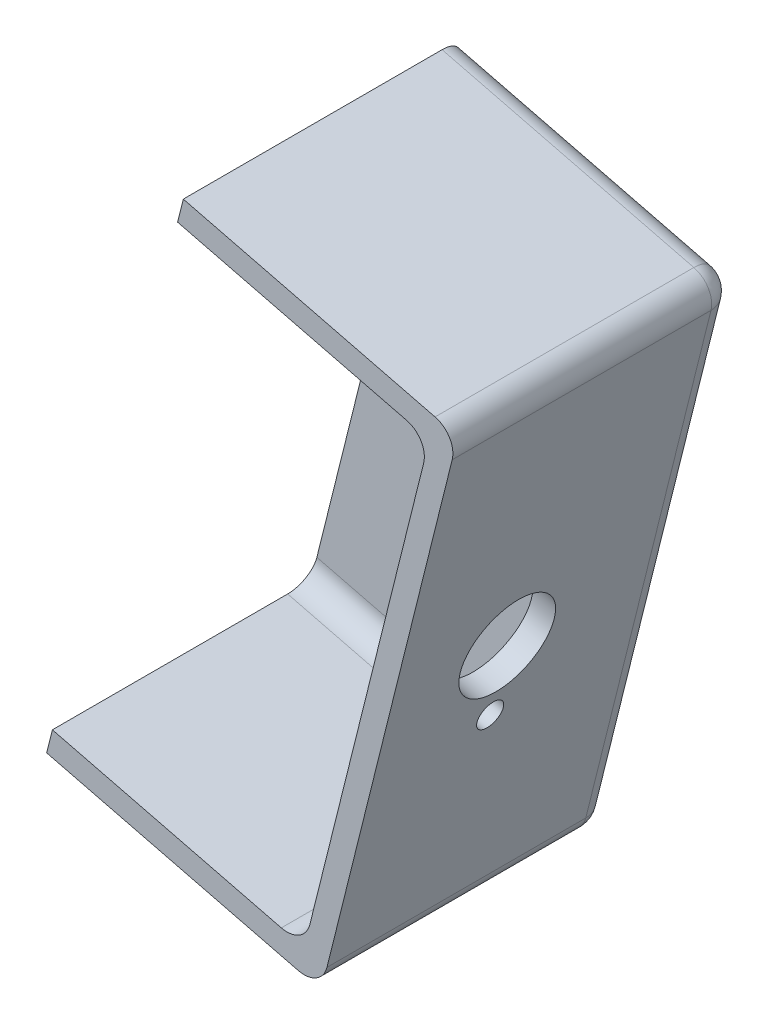
ISO-10303-21;
HEADER;
FILE_DESCRIPTION(('STEP AP214'),'2;1');
FILE_NAME('part.step','',(''),(''),'','','');
FILE_SCHEMA(('AUTOMOTIVE_DESIGN { 1 0 10303 214 1 1 1 1 }'));
ENDSEC;
DATA;
#1=APPLICATION_CONTEXT('core data for automotive mechanical design processes');
#2=APPLICATION_PROTOCOL_DEFINITION('international standard','automotive_design',2000,#1);
#3=PRODUCT_CONTEXT('',#1,'mechanical');
#4=PRODUCT('Part','Part','',(#3));
#5=PRODUCT_RELATED_PRODUCT_CATEGORY('part','',(#4));
#6=PRODUCT_DEFINITION_FORMATION('','',#4);
#7=PRODUCT_DEFINITION_CONTEXT('part definition',#1,'design');
#8=PRODUCT_DEFINITION('design','',#6,#7);
#9=PRODUCT_DEFINITION_SHAPE('','',#8);
#10=(LENGTH_UNIT() NAMED_UNIT(*) SI_UNIT(.MILLI.,.METRE.));
#11=(NAMED_UNIT(*) PLANE_ANGLE_UNIT() SI_UNIT($,.RADIAN.));
#12=(NAMED_UNIT(*) SI_UNIT($,.STERADIAN.) SOLID_ANGLE_UNIT());
#13=UNCERTAINTY_MEASURE_WITH_UNIT(LENGTH_MEASURE(1.E-05),#10,'distance_accuracy_value','');
#14=(GEOMETRIC_REPRESENTATION_CONTEXT(3) GLOBAL_UNCERTAINTY_ASSIGNED_CONTEXT((#13)) GLOBAL_UNIT_ASSIGNED_CONTEXT((#10,
#11,#12)) REPRESENTATION_CONTEXT('',''));
#15=CARTESIAN_POINT('',(0.,0.,0.));
#16=DIRECTION('',(0.,0.,1.));
#17=DIRECTION('',(1.,0.,0.));
#18=AXIS2_PLACEMENT_3D('',#15,#16,#17);
#19=CARTESIAN_POINT('',(-416.594327934417,3223.84804234116,-138.084397913877));
#20=DIRECTION('',(-0.970295726275997,0.241921895599663,0.));
#21=DIRECTION('',(-0.241921895599663,-0.970295726275998,0.));
#22=AXIS2_PLACEMENT_3D('',#19,#20,#21);
#23=PLANE('',#22);
#24=CARTESIAN_POINT('',(-428.115858212351,3177.63770837726,-15.8749999999991));
#25=DIRECTION('',(-0.970295726275997,0.241921895599663,0.));
#26=DIRECTION('',(-0.241921895599663,-0.970295726275998,0.));
#27=AXIS2_PLACEMENT_3D('',#24,#25,#26);
#28=CIRCLE('',#27,1.786001);
#29=CARTESIAN_POINT('',(-427.683785464888,3179.37065751469,-15.8749999999991));
#30=VERTEX_POINT('',#29);
#31=EDGE_CURVE('E284',#30,#30,#28,.T.);
#32=ORIENTED_EDGE('',*,*,#31,.F.);
#33=EDGE_LOOP('',(#32));
#34=FACE_BOUND('',#33,.T.);
#35=CARTESIAN_POINT('',(-425.811552156763,3186.87977517005,-15.8749999999976));
#36=DIRECTION('',(-0.970295726275997,0.241921895599663,0.));
#37=DIRECTION('',(-0.241921895599663,-0.970295726275998,0.));
#38=AXIS2_PLACEMENT_3D('',#35,#36,#37);
#39=CIRCLE('',#38,6.35);
#40=CARTESIAN_POINT('',(-424.275348119705,3193.0411530319,-15.8749999999976));
#41=VERTEX_POINT('',#40);
#42=EDGE_CURVE('E273',#41,#41,#39,.T.);
#43=ORIENTED_EDGE('',*,*,#42,.F.);
#44=EDGE_LOOP('',(#43));
#45=FACE_BOUND('',#44,.T.);
#46=DIRECTION('',(-0.241921895599663,-0.970295726275998,0.));
#47=VECTOR('',#46,1.);
#48=CARTESIAN_POINT('',(-416.594327934417,3223.84804234116,0.));
#49=LINE('',#48,#47);
#50=CARTESIAN_POINT('',(-418.130531971475,3217.68666447931,0.));
#51=VERTEX_POINT('',#50);
#52=CARTESIAN_POINT('',(-433.492152448826,3156.07456996053,0.));
#53=VERTEX_POINT('',#52);
#54=EDGE_CURVE('E174',#51,#53,#49,.T.);
#55=ORIENTED_EDGE('',*,*,#54,.F.);
#56=DIRECTION('',(0.,0.,1.));
#57=VECTOR('',#56,1.);
#58=CARTESIAN_POINT('',(-418.130531971475,3217.68666447931,-34.9249999999991));
#59=LINE('',#58,#57);
#60=CARTESIAN_POINT('',(-418.130531971475,3217.68666447931,-34.9249999999991));
#61=VERTEX_POINT('',#60);
#62=EDGE_CURVE('E229',#51,#61,#59,.F.);
#63=ORIENTED_EDGE('',*,*,#62,.T.);
#64=DIRECTION('',(-0.241921895599663,-0.970295726275998,0.));
#65=VECTOR('',#64,1.);
#66=CARTESIAN_POINT('',(-416.594327934417,3223.84804234116,-34.9249999999991));
#67=LINE('',#66,#65);
#68=CARTESIAN_POINT('',(-433.492110577548,3156.07473789706,-34.9249999999991));
#69=VERTEX_POINT('',#68);
#70=EDGE_CURVE('E198',#61,#69,#67,.T.);
#71=ORIENTED_EDGE('',*,*,#70,.T.);
#72=CARTESIAN_POINT('',(-433.492152448826,3156.07456996053,-34.9249999999991));
#73=VERTEX_POINT('',#72);
#74=EDGE_CURVE('E302',#69,#73,#67,.T.);
#75=ORIENTED_EDGE('',*,*,#74,.T.);
#76=DIRECTION('',(0.,0.,1.));
#77=VECTOR('',#76,1.);
#78=CARTESIAN_POINT('',(-433.492152448826,3156.07456996053,0.));
#79=LINE('',#78,#77);
#80=EDGE_CURVE('E227',#73,#53,#79,.T.);
#81=ORIENTED_EDGE('',*,*,#80,.T.);
#82=EDGE_LOOP('',(#55,#63,#71,#75,#81));
#83=FACE_BOUND('',#82,.T.);
#84=ADVANCED_FACE('F32',(#34,#45,#83),#23,.T.);
#85=CARTESIAN_POINT('',(-451.336692073525,3229.23808833283,-138.084397913877));
#86=DIRECTION('',(-0.241921895599663,-0.970295726275997,0.));
#87=DIRECTION('',(0.970295726275998,-0.241921895599663,0.));
#88=AXIS2_PLACEMENT_3D('',#85,#86,#87);
#89=PLANE('',#88);
#90=DIRECTION('',(0.970295726275998,-0.241921895599663,0.));
#91=VECTOR('',#90,1.);
#92=CARTESIAN_POINT('',(-451.336692073525,3229.23808833283,-31.7499999999991));
#93=LINE('',#92,#91);
#94=CARTESIAN_POINT('',(-451.336692073525,3229.23808833283,-31.7499999999991));
#95=VERTEX_POINT('',#94);
#96=CARTESIAN_POINT('',(-420.443118883872,3221.53545542876,-31.7499999999991));
#97=VERTEX_POINT('',#96);
#98=EDGE_CURVE('E224',#95,#97,#93,.T.);
#99=ORIENTED_EDGE('',*,*,#98,.T.);
#100=DIRECTION('',(0.,0.,1.));
#101=VECTOR('',#100,1.);
#102=CARTESIAN_POINT('',(-420.443118883872,3221.53545542876,0.));
#103=LINE('',#102,#101);
#104=CARTESIAN_POINT('',(-420.443118883872,3221.53545542876,0.));
#105=VERTEX_POINT('',#104);
#106=EDGE_CURVE('E173',#97,#105,#103,.T.);
#107=ORIENTED_EDGE('',*,*,#106,.T.);
#108=DIRECTION('',(0.970295726275998,-0.241921895599663,0.));
#109=VECTOR('',#108,1.);
#110=CARTESIAN_POINT('',(-451.336692073525,3229.23808833283,0.));
#111=LINE('',#110,#109);
#112=CARTESIAN_POINT('',(-451.336692073525,3229.23808833283,0.));
#113=VERTEX_POINT('',#112);
#114=EDGE_CURVE('E165',#113,#105,#111,.T.);
#115=ORIENTED_EDGE('',*,*,#114,.F.);
#116=DIRECTION('',(0.,0.,1.));
#117=VECTOR('',#116,1.);
#118=CARTESIAN_POINT('',(-451.336692073525,3229.23808833283,-138.084397913877));
#119=LINE('',#118,#117);
#120=EDGE_CURVE('E147',#95,#113,#119,.T.);
#121=ORIENTED_EDGE('',*,*,#120,.F.);
#122=EDGE_LOOP('',(#99,#107,#115,#121));
#123=FACE_BOUND('',#122,.T.);
#124=ADVANCED_FACE('F171',(#123),#89,.T.);
#125=CARTESIAN_POINT('',(-431.179649733819,3152.22615674167,-138.084397913877));
#126=DIRECTION('',(0.241869001847213,0.970308912638358,0.));
#127=DIRECTION('',(-0.970308912638358,0.241869001847213,0.));
#128=AXIS2_PLACEMENT_3D('',#125,#126,#127);
#129=PLANE('',#128);
#130=DIRECTION('',(-0.970308912638358,0.241869001847213,0.));
#131=VECTOR('',#130,1.);
#132=CARTESIAN_POINT('',(-431.179649733819,3152.22615674167,-31.7499999999991));
#133=LINE('',#132,#131);
#134=CARTESIAN_POINT('',(-437.340775460617,3153.76194118144,-31.7499999999991));
#135=VERTEX_POINT('',#134);
#136=CARTESIAN_POINT('',(-468.23493648002,3161.46293185703,-31.7499999999991));
#137=VERTEX_POINT('',#136);
#138=EDGE_CURVE('E237',#135,#137,#133,.T.);
#139=ORIENTED_EDGE('',*,*,#138,.T.);
#140=DIRECTION('',(0.,0.,1.));
#141=VECTOR('',#140,1.);
#142=CARTESIAN_POINT('',(-468.23493648002,3161.46293185703,-138.084397913877));
#143=LINE('',#142,#141);
#144=CARTESIAN_POINT('',(-468.23493648002,3161.46293185703,-38.0999999999991));
#145=VERTEX_POINT('',#144);
#146=EDGE_CURVE('E301',#145,#137,#143,.T.);
#147=ORIENTED_EDGE('',*,*,#146,.F.);
#148=DIRECTION('',(-0.970308912638358,0.241869001847213,0.));
#149=VECTOR('',#148,1.);
#150=CARTESIAN_POINT('',(-431.179649733819,3152.22615674167,-38.0999999999991));
#151=LINE('',#150,#149);
#152=CARTESIAN_POINT('',(-468.235104418826,3161.46297371915,-38.0999999999991));
#153=VERTEX_POINT('',#152);
#154=EDGE_CURVE('E197',#145,#153,#151,.T.);
#155=ORIENTED_EDGE('',*,*,#154,.T.);
#156=DIRECTION('',(0.,0.,1.));
#157=VECTOR('',#156,1.);
#158=CARTESIAN_POINT('',(-468.235104418826,3161.46297371915,-138.084397913877));
#159=LINE('',#158,#157);
#160=CARTESIAN_POINT('',(-468.235104418826,3161.46297371915,0.));
#161=VERTEX_POINT('',#160);
#162=EDGE_CURVE('E159',#153,#161,#159,.T.);
#163=ORIENTED_EDGE('',*,*,#162,.T.);
#164=DIRECTION('',(-0.970308912638358,0.241869001847213,0.));
#165=VECTOR('',#164,1.);
#166=CARTESIAN_POINT('',(-431.179649733819,3152.22615674167,0.));
#167=LINE('',#166,#165);
#168=CARTESIAN_POINT('',(-437.340775460617,3153.76194118144,0.));
#169=VERTEX_POINT('',#168);
#170=EDGE_CURVE('E175',#169,#161,#167,.T.);
#171=ORIENTED_EDGE('',*,*,#170,.F.);
#172=DIRECTION('',(0.,0.,1.));
#173=VECTOR('',#172,1.);
#174=CARTESIAN_POINT('',(-437.340775460617,3153.76194118144,-34.9249999999991));
#175=LINE('',#174,#173);
#176=EDGE_CURVE('E235',#169,#135,#175,.F.);
#177=ORIENTED_EDGE('',*,*,#176,.T.);
#178=EDGE_LOOP('',(#139,#147,#155,#163,#171,#177));
#179=FACE_BOUND('',#178,.T.);
#180=ADVANCED_FACE('F324',(#179),#129,.T.);
#181=CARTESIAN_POINT('',(-451.336692073525,3229.23808833283,-138.084397913877));
#182=DIRECTION('',(0.970295726275996,-0.24192189559967,0.));
#183=DIRECTION('',(0.24192189559967,0.970295726275996,0.));
#184=AXIS2_PLACEMENT_3D('',#181,#182,#183);
#185=PLANE('',#184);
#186=DIRECTION('',(0.,0.,1.));
#187=VECTOR('',#186,1.);
#188=CARTESIAN_POINT('',(-450.568590054996,3232.31877726375,-138.084397913877));
#189=LINE('',#188,#187);
#190=CARTESIAN_POINT('',(-450.568590054996,3232.31877726375,-34.9249999999991));
#191=VERTEX_POINT('',#190);
#192=CARTESIAN_POINT('',(-450.568590054996,3232.31877726375,0.));
#193=VERTEX_POINT('',#192);
#194=EDGE_CURVE('E168',#191,#193,#189,.T.);
#195=ORIENTED_EDGE('',*,*,#194,.F.);
#196=CARTESIAN_POINT('',(-451.336692073525,3229.23808833283,-34.9249999999991));
#197=DIRECTION('',(0.970295726275996,-0.24192189559967,0.));
#198=DIRECTION('',(0.24192189559967,0.970295726275996,0.));
#199=AXIS2_PLACEMENT_3D('',#196,#197,#198);
#200=CIRCLE('',#199,3.175);
#201=CARTESIAN_POINT('',(-451.336692073525,3229.23808833283,-38.0999999999991));
#202=VERTEX_POINT('',#201);
#203=EDGE_CURVE('E244',#191,#202,#200,.F.);
#204=ORIENTED_EDGE('',*,*,#203,.T.);
#205=DIRECTION('',(0.24192189559967,0.970295726275996,0.));
#206=VECTOR('',#205,1.);
#207=CARTESIAN_POINT('',(-451.336692073525,3229.23808833283,-38.0999999999991));
#208=LINE('',#207,#206);
#209=EDGE_CURVE('E178',#145,#202,#208,.T.);
#210=ORIENTED_EDGE('',*,*,#209,.F.);
#211=ORIENTED_EDGE('',*,*,#146,.T.);
#212=CARTESIAN_POINT('',(-467.46683446035,3164.54362079253,-31.7499999999991));
#213=DIRECTION('',(0.970295726275996,-0.24192189559967,0.));
#214=DIRECTION('',(-0.24192189559967,-0.970295726275996,0.));
#215=AXIS2_PLACEMENT_3D('',#212,#213,#214);
#216=ELLIPSE('',#215,3.17500000471746,3.175);
#217=CARTESIAN_POINT('',(-467.46683446035,3164.54362079253,-34.9249999999991));
#218=VERTEX_POINT('',#217);
#219=EDGE_CURVE('E41',#137,#218,#216,.T.);
#220=ORIENTED_EDGE('',*,*,#219,.T.);
#221=DIRECTION('',(0.241921895599663,0.970295726275997,0.));
#222=VECTOR('',#221,1.);
#223=CARTESIAN_POINT('',(-469.00303849969,3158.38224292152,-34.9249999999991));
#224=LINE('',#223,#222);
#225=CARTESIAN_POINT('',(-452.104794092054,3226.1573994019,-34.9249999999991));
#226=VERTEX_POINT('',#225);
#227=EDGE_CURVE('E299',#218,#226,#224,.T.);
#228=ORIENTED_EDGE('',*,*,#227,.T.);
#229=CARTESIAN_POINT('',(-452.104794092054,3226.1573994019,-31.7499999999991));
#230=DIRECTION('',(0.970295726275996,-0.24192189559967,0.));
#231=DIRECTION('',(0.24192189559967,0.970295726275996,0.));
#232=AXIS2_PLACEMENT_3D('',#229,#230,#231);
#233=CIRCLE('',#232,3.175);
#234=EDGE_CURVE('E155',#226,#95,#233,.T.);
#235=ORIENTED_EDGE('',*,*,#234,.T.);
#236=ORIENTED_EDGE('',*,*,#120,.T.);
#237=DIRECTION('',(0.24192189559967,0.970295726275996,0.));
#238=VECTOR('',#237,1.);
#239=CARTESIAN_POINT('',(-451.336692073525,3229.23808833283,0.));
#240=LINE('',#239,#238);
#241=EDGE_CURVE('E151',#113,#193,#240,.T.);
#242=ORIENTED_EDGE('',*,*,#241,.T.);
#243=EDGE_LOOP('',(#195,#204,#210,#211,#220,#228,#235,#236,#242));
#244=FACE_BOUND('',#243,.T.);
#245=ADVANCED_FACE('F150',(#244),#185,.F.);
#246=CARTESIAN_POINT('',(-450.568590054996,3232.31877726375,-138.084397913877));
#247=DIRECTION('',(-0.241921895599663,-0.970295726275997,0.));
#248=DIRECTION('',(0.970295726275998,-0.241921895599663,0.));
#249=AXIS2_PLACEMENT_3D('',#246,#247,#248);
#250=PLANE('',#249);
#251=DIRECTION('',(0.970295726275998,-0.241921895599663,0.));
#252=VECTOR('',#251,1.);
#253=CARTESIAN_POINT('',(-450.568590054996,3232.31877726375,0.));
#254=LINE('',#253,#252);
#255=CARTESIAN_POINT('',(-416.594327934417,3223.84804234116,0.));
#256=VERTEX_POINT('',#255);
#257=EDGE_CURVE('E167',#193,#256,#254,.T.);
#258=ORIENTED_EDGE('',*,*,#257,.T.);
#259=DIRECTION('',(0.,0.,1.));
#260=VECTOR('',#259,1.);
#261=CARTESIAN_POINT('',(-416.594327934417,3223.84804234116,-138.084397913877));
#262=LINE('',#261,#260);
#263=CARTESIAN_POINT('',(-416.594327934417,3223.84804234116,-34.9249999999991));
#264=VERTEX_POINT('',#263);
#265=EDGE_CURVE('E222',#256,#264,#262,.F.);
#266=ORIENTED_EDGE('',*,*,#265,.T.);
#267=DIRECTION('',(0.970295726275998,-0.241921895599663,0.));
#268=VECTOR('',#267,1.);
#269=CARTESIAN_POINT('',(-450.568590054996,3232.31877726375,-34.9249999999991));
#270=LINE('',#269,#268);
#271=EDGE_CURVE('E220',#264,#191,#270,.F.);
#272=ORIENTED_EDGE('',*,*,#271,.T.);
#273=ORIENTED_EDGE('',*,*,#194,.T.);
#274=EDGE_LOOP('',(#258,#266,#272,#273));
#275=FACE_BOUND('',#274,.T.);
#276=ADVANCED_FACE('F346',(#275),#250,.F.);
#277=CARTESIAN_POINT('',(-413.513639003491,3223.07994032263,-138.084397913877));
#278=DIRECTION('',(-0.970295726275998,0.241921895599663,0.));
#279=DIRECTION('',(-0.241921895599663,-0.970295726275998,0.));
#280=AXIS2_PLACEMENT_3D('',#277,#278,#279);
#281=PLANE('',#280);
#282=CARTESIAN_POINT('',(-425.035169281425,3176.86960635874,-15.8749999999991));
#283=DIRECTION('',(0.970295726275998,-0.241921895599663,0.));
#284=DIRECTION('',(0.241921895599663,0.970295726275998,0.));
#285=AXIS2_PLACEMENT_3D('',#282,#283,#284);
#286=CIRCLE('',#285,1.786001);
#287=CARTESIAN_POINT('',(-424.603096533962,3178.60255549616,-15.8749999999991));
#288=VERTEX_POINT('',#287);
#289=EDGE_CURVE('E567',#288,#288,#286,.T.);
#290=ORIENTED_EDGE('',*,*,#289,.F.);
#291=EDGE_LOOP('',(#290));
#292=FACE_BOUND('',#291,.T.);
#293=CARTESIAN_POINT('',(-422.730863225837,3186.11167315152,-15.8749999999976));
#294=DIRECTION('',(0.970295726275998,-0.241921895599663,0.));
#295=DIRECTION('',(0.241921895599663,0.970295726275998,0.));
#296=AXIS2_PLACEMENT_3D('',#293,#294,#295);
#297=CIRCLE('',#296,6.35);
#298=CARTESIAN_POINT('',(-421.194659188779,3192.27305101337,-15.8749999999976));
#299=VERTEX_POINT('',#298);
#300=EDGE_CURVE('E279',#299,#299,#297,.T.);
#301=ORIENTED_EDGE('',*,*,#300,.F.);
#302=EDGE_LOOP('',(#301));
#303=FACE_BOUND('',#302,.T.);
#304=DIRECTION('',(-0.241921895599663,-0.970295726275998,0.));
#305=VECTOR('',#304,1.);
#306=CARTESIAN_POINT('',(-413.513639003491,3223.07994032263,-34.9249999999991));
#307=LINE('',#306,#305);
#308=CARTESIAN_POINT('',(-431.179523666292,3152.22594694302,-34.9249999999991));
#309=VERTEX_POINT('',#308);
#310=CARTESIAN_POINT('',(-414.28174102202,3219.9992513917,-34.9249999999991));
#311=VERTEX_POINT('',#310);
#312=EDGE_CURVE('E212',#309,#311,#307,.F.);
#313=ORIENTED_EDGE('',*,*,#312,.T.);
#314=DIRECTION('',(0.,0.,1.));
#315=VECTOR('',#314,1.);
#316=CARTESIAN_POINT('',(-414.28174102202,3219.9992513917,-138.084397913877));
#317=LINE('',#316,#315);
#318=CARTESIAN_POINT('',(-414.28174102202,3219.9992513917,0.));
#319=VERTEX_POINT('',#318);
#320=EDGE_CURVE('E214',#311,#319,#317,.T.);
#321=ORIENTED_EDGE('',*,*,#320,.T.);
#322=DIRECTION('',(-0.241921895599663,-0.970295726275997,0.));
#323=VECTOR('',#322,1.);
#324=CARTESIAN_POINT('',(-413.513639003491,3223.07994032263,0.));
#325=LINE('',#324,#323);
#326=CARTESIAN_POINT('',(-431.179523666292,3152.22594694302,0.));
#327=VERTEX_POINT('',#326);
#328=EDGE_CURVE('E185',#319,#327,#325,.T.);
#329=ORIENTED_EDGE('',*,*,#328,.T.);
#330=DIRECTION('',(0.,0.,1.));
#331=VECTOR('',#330,1.);
#332=CARTESIAN_POINT('',(-431.179523666292,3152.22594694302,-138.084397913877));
#333=LINE('',#332,#331);
#334=EDGE_CURVE('E210',#327,#309,#333,.F.);
#335=ORIENTED_EDGE('',*,*,#334,.T.);
#336=EDGE_LOOP('',(#313,#321,#329,#335));
#337=FACE_BOUND('',#336,.T.);
#338=ADVANCED_FACE('F337',(#292,#303,#337),#281,.F.);
#339=CARTESIAN_POINT('',(-431.947583814684,3149.14542594404,-138.084397913877));
#340=DIRECTION('',(0.241869001847213,0.970308912638358,0.));
#341=DIRECTION('',(-0.970308912638358,0.241869001847213,0.));
#342=AXIS2_PLACEMENT_3D('',#339,#340,#341);
#343=PLANE('',#342);
#344=DIRECTION('',(0.,0.,1.));
#345=VECTOR('',#344,1.);
#346=CARTESIAN_POINT('',(-469.00303849969,3158.38224292152,-138.084397913877));
#347=LINE('',#346,#345);
#348=CARTESIAN_POINT('',(-469.00303849969,3158.38224292152,-34.9249999999991));
#349=VERTEX_POINT('',#348);
#350=CARTESIAN_POINT('',(-469.00303849969,3158.38224292152,0.));
#351=VERTEX_POINT('',#350);
#352=EDGE_CURVE('E191',#349,#351,#347,.T.);
#353=ORIENTED_EDGE('',*,*,#352,.F.);
#354=DIRECTION('',(-0.970308912638358,0.241869001847213,0.));
#355=VECTOR('',#354,1.);
#356=CARTESIAN_POINT('',(-431.947583814684,3149.14542594404,-34.9249999999991));
#357=LINE('',#356,#355);
#358=CARTESIAN_POINT('',(-435.028146678083,3149.91331816393,-34.9249999999991));
#359=VERTEX_POINT('',#358);
#360=EDGE_CURVE('E49',#349,#359,#357,.F.);
#361=ORIENTED_EDGE('',*,*,#360,.T.);
#362=DIRECTION('',(0.,0.,1.));
#363=VECTOR('',#362,1.);
#364=CARTESIAN_POINT('',(-435.028146678083,3149.91331816393,-138.084397913877));
#365=LINE('',#364,#363);
#366=CARTESIAN_POINT('',(-435.028146678083,3149.91331816393,0.));
#367=VERTEX_POINT('',#366);
#368=EDGE_CURVE('E241',#359,#367,#365,.T.);
#369=ORIENTED_EDGE('',*,*,#368,.T.);
#370=DIRECTION('',(-0.970308912638358,0.241869001847213,0.));
#371=VECTOR('',#370,1.);
#372=CARTESIAN_POINT('',(-431.947583814684,3149.14542594404,0.));
#373=LINE('',#372,#371);
#374=EDGE_CURVE('E188',#367,#351,#373,.T.);
#375=ORIENTED_EDGE('',*,*,#374,.T.);
#376=EDGE_LOOP('',(#353,#361,#369,#375));
#377=FACE_BOUND('',#376,.T.);
#378=ADVANCED_FACE('F502',(#377),#343,.F.);
#379=CARTESIAN_POINT('',(-469.00303849969,3158.38224292152,-138.084397913877));
#380=DIRECTION('',(0.970308912638355,-0.241869001847225,0.));
#381=DIRECTION('',(0.241869001847225,0.970308912638355,0.));
#382=AXIS2_PLACEMENT_3D('',#379,#380,#381);
#383=PLANE('',#382);
#384=ORIENTED_EDGE('',*,*,#162,.F.);
#385=CARTESIAN_POINT('',(-468.235104418826,3161.46297371915,-34.9249999999991));
#386=DIRECTION('',(0.970308912638355,-0.241869001847225,0.));
#387=DIRECTION('',(0.241869001847225,0.970308912638355,0.));
#388=AXIS2_PLACEMENT_3D('',#385,#386,#387);
#389=CIRCLE('',#388,3.175);
#390=EDGE_CURVE('E57',#153,#349,#389,.F.);
#391=ORIENTED_EDGE('',*,*,#390,.T.);
#392=ORIENTED_EDGE('',*,*,#352,.T.);
#393=DIRECTION('',(0.241869001847225,0.970308912638355,0.));
#394=VECTOR('',#393,1.);
#395=CARTESIAN_POINT('',(-469.00303849969,3158.38224292152,0.));
#396=LINE('',#395,#394);
#397=EDGE_CURVE('E180',#351,#161,#396,.T.);
#398=ORIENTED_EDGE('',*,*,#397,.T.);
#399=EDGE_LOOP('',(#384,#391,#392,#398));
#400=FACE_BOUND('',#399,.T.);
#401=ADVANCED_FACE('F327',(#400),#383,.F.);
#402=CARTESIAN_POINT('',(0.,0.,0.));
#403=DIRECTION('',(0.,0.,-1.));
#404=DIRECTION('',(-1.,0.,0.));
#405=AXIS2_PLACEMENT_3D('',#402,#403,#404);
#406=PLANE('',#405);
#407=ORIENTED_EDGE('',*,*,#328,.F.);
#408=CARTESIAN_POINT('',(-417.362429952946,3220.76735341023,0.));
#409=DIRECTION('',(0.,0.,-1.));
#410=DIRECTION('',(-1.,0.,0.));
#411=AXIS2_PLACEMENT_3D('',#408,#409,#410);
#412=CIRCLE('',#411,3.175);
#413=EDGE_CURVE('E218',#319,#256,#412,.F.);
#414=ORIENTED_EDGE('',*,*,#413,.T.);
#415=ORIENTED_EDGE('',*,*,#257,.F.);
#416=ORIENTED_EDGE('',*,*,#241,.F.);
#417=ORIENTED_EDGE('',*,*,#114,.T.);
#418=CARTESIAN_POINT('',(-421.211220902401,3218.45476649783,0.));
#419=DIRECTION('',(0.,0.,-1.));
#420=DIRECTION('',(-1.,0.,0.));
#421=AXIS2_PLACEMENT_3D('',#418,#419,#420);
#422=CIRCLE('',#421,3.175);
#423=EDGE_CURVE('E246',#105,#51,#422,.T.);
#424=ORIENTED_EDGE('',*,*,#423,.T.);
#425=ORIENTED_EDGE('',*,*,#54,.T.);
#426=CARTESIAN_POINT('',(-436.572841379752,3156.84267197906,0.));
#427=DIRECTION('',(0.,0.,-1.));
#428=DIRECTION('',(-1.,0.,0.));
#429=AXIS2_PLACEMENT_3D('',#426,#427,#428);
#430=CIRCLE('',#429,3.175);
#431=EDGE_CURVE('E11',#53,#169,#430,.T.);
#432=ORIENTED_EDGE('',*,*,#431,.T.);
#433=ORIENTED_EDGE('',*,*,#170,.T.);
#434=ORIENTED_EDGE('',*,*,#397,.F.);
#435=ORIENTED_EDGE('',*,*,#374,.F.);
#436=CARTESIAN_POINT('',(-434.260212597218,3152.99404896155,0.));
#437=DIRECTION('',(0.,0.,-1.));
#438=DIRECTION('',(-1.,0.,0.));
#439=AXIS2_PLACEMENT_3D('',#436,#437,#438);
#440=CIRCLE('',#439,3.175);
#441=EDGE_CURVE('E216',#367,#327,#440,.F.);
#442=ORIENTED_EDGE('',*,*,#441,.T.);
#443=EDGE_LOOP('',(#407,#414,#415,#416,#417,#424,#425,#432,#433,#434,#435,#442));
#444=FACE_BOUND('',#443,.T.);
#445=ADVANCED_FACE('F164',(#444),#406,.F.);
#446=CARTESIAN_POINT('',(-433.956023493401,3154.54203193787,-38.0999999999991));
#447=DIRECTION('',(0.,0.,-1.));
#448=DIRECTION('',(-0.970295726275996,0.241921895599668,0.));
#449=AXIS2_PLACEMENT_3D('',#446,#447,#448);
#450=PLANE('',#449);
#451=CARTESIAN_POINT('',(-439.773757511538,3209.99413358555,-38.0999999999991));
#452=DIRECTION('',(0.,0.,1.));
#453=DIRECTION('',(1.,0.,0.));
#454=AXIS2_PLACEMENT_3D('',#451,#452,#453);
#455=CIRCLE('',#454,2.45745000000003);
#456=CARTESIAN_POINT('',(-437.316307511538,3209.99413358555,-38.0999999999991));
#457=VERTEX_POINT('',#456);
#458=EDGE_CURVE('E290',#457,#457,#455,.T.);
#459=ORIENTED_EDGE('',*,*,#458,.T.);
#460=EDGE_LOOP('',(#459));
#461=FACE_BOUND('',#460,.T.);
#462=CARTESIAN_POINT('',(-448.990981733885,3173.02586641444,-38.0999999999991));
#463=DIRECTION('',(0.,0.,1.));
#464=DIRECTION('',(1.,0.,0.));
#465=AXIS2_PLACEMENT_3D('',#462,#463,#464);
#466=CIRCLE('',#465,2.45744999999997);
#467=CARTESIAN_POINT('',(-446.533531733885,3173.02586641444,-38.0999999999991));
#468=VERTEX_POINT('',#467);
#469=EDGE_CURVE('E296',#468,#468,#466,.T.);
#470=ORIENTED_EDGE('',*,*,#469,.T.);
#471=EDGE_LOOP('',(#470));
#472=FACE_BOUND('',#471,.T.);
#473=DIRECTION('',(-0.241921895599663,-0.970295726275998,0.));
#474=VECTOR('',#473,1.);
#475=CARTESIAN_POINT('',(-435.02827274561,3149.91352796257,-38.0999999999991));
#476=LINE('',#475,#474);
#477=CARTESIAN_POINT('',(-417.362429952946,3220.76735341023,-38.0999999999991));
#478=VERTEX_POINT('',#477);
#479=CARTESIAN_POINT('',(-434.260212597218,3152.99404896155,-38.0999999999991));
#480=VERTEX_POINT('',#479);
#481=EDGE_CURVE('E205',#478,#480,#476,.T.);
#482=ORIENTED_EDGE('',*,*,#481,.T.);
#483=DIRECTION('',(-0.970308912638358,0.241869001847213,0.));
#484=VECTOR('',#483,1.);
#485=CARTESIAN_POINT('',(-468.235104418826,3161.46297371915,-38.0999999999991));
#486=LINE('',#485,#484);
#487=EDGE_CURVE('E208',#480,#145,#486,.T.);
#488=ORIENTED_EDGE('',*,*,#487,.T.);
#489=ORIENTED_EDGE('',*,*,#209,.T.);
#490=DIRECTION('',(0.970295726275998,-0.241921895599663,0.));
#491=VECTOR('',#490,1.);
#492=CARTESIAN_POINT('',(-414.28174102202,3219.9992513917,-38.0999999999991));
#493=LINE('',#492,#491);
#494=EDGE_CURVE('E196',#202,#478,#493,.T.);
#495=ORIENTED_EDGE('',*,*,#494,.T.);
#496=EDGE_LOOP('',(#482,#488,#489,#495));
#497=FACE_BOUND('',#496,.T.);
#498=ADVANCED_FACE('F355',(#461,#472,#497),#450,.T.);
#499=CARTESIAN_POINT('',(0.,0.,-34.9249999999991));
#500=DIRECTION('',(0.,0.,-1.));
#501=DIRECTION('',(-1.,0.,0.));
#502=AXIS2_PLACEMENT_3D('',#499,#500,#501);
#503=PLANE('',#502);
#504=CARTESIAN_POINT('',(-439.773757511538,3209.99413358555,-34.9249999999991));
#505=DIRECTION('',(0.,0.,1.));
#506=DIRECTION('',(1.,0.,0.));
#507=AXIS2_PLACEMENT_3D('',#504,#505,#506);
#508=CIRCLE('',#507,2.45745000000003);
#509=CARTESIAN_POINT('',(-437.316307511538,3209.99413358555,-34.9249999999991));
#510=VERTEX_POINT('',#509);
#511=EDGE_CURVE('E267',#510,#510,#508,.T.);
#512=ORIENTED_EDGE('',*,*,#511,.F.);
#513=EDGE_LOOP('',(#512));
#514=FACE_BOUND('',#513,.T.);
#515=CARTESIAN_POINT('',(-448.990981733885,3173.02586641444,-34.9249999999991));
#516=DIRECTION('',(0.,0.,1.));
#517=DIRECTION('',(1.,0.,0.));
#518=AXIS2_PLACEMENT_3D('',#515,#516,#517);
#519=CIRCLE('',#518,2.45744999999997);
#520=CARTESIAN_POINT('',(-446.533531733885,3173.02586641444,-34.9249999999991));
#521=VERTEX_POINT('',#520);
#522=EDGE_CURVE('E293',#521,#521,#519,.T.);
#523=ORIENTED_EDGE('',*,*,#522,.F.);
#524=EDGE_LOOP('',(#523));
#525=FACE_BOUND('',#524,.T.);
#526=ORIENTED_EDGE('',*,*,#70,.F.);
#527=DIRECTION('',(0.970295726275998,-0.241921895599663,0.));
#528=VECTOR('',#527,1.);
#529=CARTESIAN_POINT('',(730.834600830979,2931.21748258123,-34.9249999999991));
#530=LINE('',#529,#528);
#531=EDGE_CURVE('E233',#61,#226,#530,.F.);
#532=ORIENTED_EDGE('',*,*,#531,.T.);
#533=ORIENTED_EDGE('',*,*,#227,.F.);
#534=DIRECTION('',(-0.970308912638358,0.241869001847213,0.));
#535=VECTOR('',#534,1.);
#536=CARTESIAN_POINT('',(715.332203071171,2869.70718379051,-34.9249999999991));
#537=LINE('',#536,#535);
#538=EDGE_CURVE('E231',#218,#69,#537,.F.);
#539=ORIENTED_EDGE('',*,*,#538,.T.);
#540=EDGE_LOOP('',(#526,#532,#533,#539));
#541=FACE_BOUND('',#540,.T.);
#542=ADVANCED_FACE('F314',(#514,#525,#541),#503,.F.);
#543=CARTESIAN_POINT('',(-448.990981733885,3173.02586641444,-34.9249999999991));
#544=DIRECTION('',(0.,0.,1.));
#545=DIRECTION('',(1.,0.,0.));
#546=AXIS2_PLACEMENT_3D('',#543,#544,#545);
#547=CYLINDRICAL_SURFACE('',#546,2.45744999999997);
#548=ORIENTED_EDGE('',*,*,#469,.F.);
#549=EDGE_LOOP('',(#548));
#550=FACE_BOUND('',#549,.T.);
#551=ORIENTED_EDGE('',*,*,#522,.T.);
#552=EDGE_LOOP('',(#551));
#553=FACE_BOUND('',#552,.T.);
#554=ADVANCED_FACE('F474',(#550,#553),#547,.F.);
#555=CARTESIAN_POINT('',(-439.773757511538,3209.99413358555,-34.9249999999991));
#556=DIRECTION('',(0.,0.,1.));
#557=DIRECTION('',(1.,0.,0.));
#558=AXIS2_PLACEMENT_3D('',#555,#556,#557);
#559=CYLINDRICAL_SURFACE('',#558,2.45745000000003);
#560=ORIENTED_EDGE('',*,*,#458,.F.);
#561=EDGE_LOOP('',(#560));
#562=FACE_BOUND('',#561,.T.);
#563=ORIENTED_EDGE('',*,*,#511,.T.);
#564=EDGE_LOOP('',(#563));
#565=FACE_BOUND('',#564,.T.);
#566=ADVANCED_FACE('F464',(#562,#565),#559,.F.);
#567=CARTESIAN_POINT('',(-417.362429952946,3220.76735341023,-138.084397913877));
#568=DIRECTION('',(0.,0.,1.));
#569=DIRECTION('',(1.,0.,0.));
#570=AXIS2_PLACEMENT_3D('',#567,#568,#569);
#571=CYLINDRICAL_SURFACE('',#570,3.175);
#572=ORIENTED_EDGE('',*,*,#413,.F.);
#573=ORIENTED_EDGE('',*,*,#320,.F.);
#574=CARTESIAN_POINT('',(-417.362429952946,3220.76735341023,-34.9249999999991));
#575=DIRECTION('',(0.,0.,-1.));
#576=DIRECTION('',(-1.,0.,0.));
#577=AXIS2_PLACEMENT_3D('',#574,#575,#576);
#578=CIRCLE('',#577,3.175);
#579=EDGE_CURVE('E265',#264,#311,#578,.T.);
#580=ORIENTED_EDGE('',*,*,#579,.F.);
#581=ORIENTED_EDGE('',*,*,#265,.F.);
#582=EDGE_LOOP('',(#572,#573,#580,#581));
#583=FACE_BOUND('',#582,.T.);
#584=ADVANCED_FACE('F342',(#583),#571,.T.);
#585=CARTESIAN_POINT('',(-417.439410876073,3220.78654691005,-34.9249999999991));
#586=DIRECTION('',(-0.970295726275998,0.241921895599663,0.));
#587=DIRECTION('',(-0.241921895599663,-0.970295726275998,0.));
#588=AXIS2_PLACEMENT_3D('',#585,#586,#587);
#589=CYLINDRICAL_SURFACE('',#588,3.175);
#590=ORIENTED_EDGE('',*,*,#203,.F.);
#591=ORIENTED_EDGE('',*,*,#271,.F.);
#592=CARTESIAN_POINT('',(-417.362429952946,3220.76735341023,-34.9249999999991));
#593=DIRECTION('',(0.970295726275996,-0.24192189559967,0.));
#594=DIRECTION('',(0.24192189559967,0.970295726275996,0.));
#595=AXIS2_PLACEMENT_3D('',#592,#593,#594);
#596=CIRCLE('',#595,3.175);
#597=EDGE_CURVE('E262',#478,#264,#596,.T.);
#598=ORIENTED_EDGE('',*,*,#597,.F.);
#599=ORIENTED_EDGE('',*,*,#494,.F.);
#600=EDGE_LOOP('',(#590,#591,#598,#599));
#601=FACE_BOUND('',#600,.T.);
#602=ADVANCED_FACE('F350',(#601),#589,.T.);
#603=CARTESIAN_POINT('',(-434.337111226904,3153.01321749084,-34.9249999999991));
#604=DIRECTION('',(0.970308912638358,-0.241869001847213,0.));
#605=DIRECTION('',(0.241869001847213,0.970308912638358,0.));
#606=AXIS2_PLACEMENT_3D('',#603,#604,#605);
#607=CYLINDRICAL_SURFACE('',#606,3.175);
#608=ORIENTED_EDGE('',*,*,#154,.F.);
#609=ORIENTED_EDGE('',*,*,#487,.F.);
#610=CARTESIAN_POINT('',(-434.260212597218,3152.99404896155,-34.9249999999991));
#611=DIRECTION('',(0.970308912638355,-0.241869001847225,0.));
#612=DIRECTION('',(0.241869001847225,0.970308912638355,0.));
#613=AXIS2_PLACEMENT_3D('',#610,#611,#612);
#614=CIRCLE('',#613,3.175);
#615=EDGE_CURVE('E259',#359,#480,#614,.T.);
#616=ORIENTED_EDGE('',*,*,#615,.F.);
#617=ORIENTED_EDGE('',*,*,#360,.F.);
#618=ORIENTED_EDGE('',*,*,#390,.F.);
#619=EDGE_LOOP('',(#608,#609,#616,#617,#618));
#620=FACE_BOUND('',#619,.T.);
#621=ADVANCED_FACE('F359',(#620),#607,.T.);
#622=CARTESIAN_POINT('',(-434.260212597218,3152.99404896155,-138.084397913877));
#623=DIRECTION('',(0.,0.,1.));
#624=DIRECTION('',(1.,0.,0.));
#625=AXIS2_PLACEMENT_3D('',#622,#623,#624);
#626=CYLINDRICAL_SURFACE('',#625,3.175);
#627=ORIENTED_EDGE('',*,*,#441,.F.);
#628=ORIENTED_EDGE('',*,*,#368,.F.);
#629=CARTESIAN_POINT('',(-434.260212597218,3152.99404896155,-34.9249999999991));
#630=DIRECTION('',(0.,0.,-1.));
#631=DIRECTION('',(-1.,0.,0.));
#632=AXIS2_PLACEMENT_3D('',#629,#630,#631);
#633=CIRCLE('',#632,3.175);
#634=EDGE_CURVE('E256',#309,#359,#633,.T.);
#635=ORIENTED_EDGE('',*,*,#634,.F.);
#636=ORIENTED_EDGE('',*,*,#334,.F.);
#637=EDGE_LOOP('',(#627,#628,#635,#636));
#638=FACE_BOUND('',#637,.T.);
#639=ADVANCED_FACE('F332',(#638),#626,.T.);
#640=CARTESIAN_POINT('',(-417.362429952946,3220.76735341023,-34.9249999999991));
#641=DIRECTION('',(0.,0.,1.));
#642=DIRECTION('',(1.,0.,0.));
#643=AXIS2_PLACEMENT_3D('',#640,#641,#642);
#644=SPHERICAL_SURFACE('',#643,3.175);
#645=ORIENTED_EDGE('',*,*,#597,.T.);
#646=ORIENTED_EDGE('',*,*,#579,.T.);
#647=CARTESIAN_POINT('',(-417.362429952946,3220.76735341023,-34.9249999999991));
#648=DIRECTION('',(0.241921895599703,0.970295726275988,0.));
#649=DIRECTION('',(-0.970295726275988,0.241921895599703,0.));
#650=AXIS2_PLACEMENT_3D('',#647,#648,#649);
#651=CIRCLE('',#650,3.175);
#652=EDGE_CURVE('E252',#478,#311,#651,.F.);
#653=ORIENTED_EDGE('',*,*,#652,.F.);
#654=EDGE_LOOP('',(#645,#646,#653));
#655=FACE_BOUND('',#654,.T.);
#656=ADVANCED_FACE('F366',(#655),#644,.T.);
#657=CARTESIAN_POINT('',(-434.260212597218,3152.99404896155,-34.9249999999991));
#658=DIRECTION('',(0.,0.,1.));
#659=DIRECTION('',(1.,0.,0.));
#660=AXIS2_PLACEMENT_3D('',#657,#658,#659);
#661=SPHERICAL_SURFACE('',#660,3.175);
#662=ORIENTED_EDGE('',*,*,#634,.T.);
#663=ORIENTED_EDGE('',*,*,#615,.T.);
#664=CARTESIAN_POINT('',(-434.260212597218,3152.99404896155,-34.9249999999991));
#665=DIRECTION('',(-0.241921895599698,-0.970295726275989,0.));
#666=DIRECTION('',(0.970295726275989,-0.241921895599698,0.));
#667=AXIS2_PLACEMENT_3D('',#664,#665,#666);
#668=CIRCLE('',#667,3.175);
#669=EDGE_CURVE('E250',#309,#480,#668,.F.);
#670=ORIENTED_EDGE('',*,*,#669,.F.);
#671=EDGE_LOOP('',(#662,#663,#670));
#672=FACE_BOUND('',#671,.T.);
#673=ADVANCED_FACE('F362',(#672),#661,.T.);
#674=CARTESIAN_POINT('',(-433.879042570274,3154.52283843805,-34.9249999999991));
#675=DIRECTION('',(0.241921895599663,0.970295726275998,0.));
#676=DIRECTION('',(-0.970295726275998,0.241921895599663,0.));
#677=AXIS2_PLACEMENT_3D('',#674,#675,#676);
#678=CYLINDRICAL_SURFACE('',#677,3.175);
#679=ORIENTED_EDGE('',*,*,#652,.T.);
#680=ORIENTED_EDGE('',*,*,#312,.F.);
#681=ORIENTED_EDGE('',*,*,#669,.T.);
#682=ORIENTED_EDGE('',*,*,#481,.F.);
#683=EDGE_LOOP('',(#679,#680,#681,#682));
#684=FACE_BOUND('',#683,.T.);
#685=ADVANCED_FACE('F364',(#684),#678,.T.);
#686=CARTESIAN_POINT('',(-452.104794092054,3226.1573994019,-31.7499999999991));
#687=DIRECTION('',(0.970295726275998,-0.241921895599663,0.));
#688=DIRECTION('',(0.241921895599663,0.970295726275998,0.));
#689=AXIS2_PLACEMENT_3D('',#686,#687,#688);
#690=CYLINDRICAL_SURFACE('',#689,3.175);
#691=ORIENTED_EDGE('',*,*,#234,.F.);
#692=ORIENTED_EDGE('',*,*,#531,.F.);
#693=CARTESIAN_POINT('',(-421.211220902401,3218.45476649783,-31.7499999999992));
#694=DIRECTION('',(-0.686102687806084,0.171064612896026,-0.707106781186547));
#695=DIRECTION('',(0.686102687806084,-0.171064612896026,-0.707106781186547));
#696=AXIS2_PLACEMENT_3D('',#693,#694,#695);
#697=ELLIPSE('',#696,4.49012806053458,3.175);
#698=EDGE_CURVE('E253',#97,#61,#697,.T.);
#699=ORIENTED_EDGE('',*,*,#698,.F.);
#700=ORIENTED_EDGE('',*,*,#98,.F.);
#701=EDGE_LOOP('',(#691,#692,#699,#700));
#702=FACE_BOUND('',#701,.T.);
#703=ADVANCED_FACE('F316',(#702),#690,.F.);
#704=CARTESIAN_POINT('',(-421.211220902401,3218.45476649783,-138.084397913877));
#705=DIRECTION('',(0.,0.,-1.));
#706=DIRECTION('',(-1.,0.,0.));
#707=AXIS2_PLACEMENT_3D('',#704,#705,#706);
#708=CYLINDRICAL_SURFACE('',#707,3.175);
#709=ORIENTED_EDGE('',*,*,#698,.T.);
#710=ORIENTED_EDGE('',*,*,#62,.F.);
#711=ORIENTED_EDGE('',*,*,#423,.F.);
#712=ORIENTED_EDGE('',*,*,#106,.F.);
#713=EDGE_LOOP('',(#709,#710,#711,#712));
#714=FACE_BOUND('',#713,.T.);
#715=ADVANCED_FACE('F317',(#714),#708,.F.);
#716=CARTESIAN_POINT('',(-436.572841379752,3156.84267197906,-138.084397913877));
#717=DIRECTION('',(0.,0.,-1.));
#718=DIRECTION('',(-1.,0.,0.));
#719=AXIS2_PLACEMENT_3D('',#716,#717,#718);
#720=CYLINDRICAL_SURFACE('',#719,3.175);
#721=ORIENTED_EDGE('',*,*,#431,.F.);
#722=ORIENTED_EDGE('',*,*,#80,.F.);
#723=CARTESIAN_POINT('',(-436.572841379752,3156.84267197906,-31.7499999999991));
#724=DIRECTION('',(-0.686112011972328,0.171027211364986,-0.707106781186547));
#725=DIRECTION('',(-0.686112011972328,0.171027211364986,0.707106781186547));
#726=AXIS2_PLACEMENT_3D('',#723,#724,#725);
#727=ELLIPSE('',#726,4.49012806053458,3.175);
#728=EDGE_CURVE('E36',#135,#73,#727,.F.);
#729=ORIENTED_EDGE('',*,*,#728,.F.);
#730=ORIENTED_EDGE('',*,*,#176,.F.);
#731=EDGE_LOOP('',(#721,#722,#729,#730));
#732=FACE_BOUND('',#731,.T.);
#733=ADVANCED_FACE('F34',(#732),#720,.F.);
#734=CARTESIAN_POINT('',(-430.411715652954,3155.3068875393,-31.7499999999991));
#735=DIRECTION('',(-0.970308912638358,0.241869001847213,0.));
#736=DIRECTION('',(-0.241869001847213,-0.970308912638358,0.));
#737=AXIS2_PLACEMENT_3D('',#734,#735,#736);
#738=CYLINDRICAL_SURFACE('',#737,3.175);
#739=ORIENTED_EDGE('',*,*,#74,.F.);
#740=ORIENTED_EDGE('',*,*,#538,.F.);
#741=ORIENTED_EDGE('',*,*,#219,.F.);
#742=ORIENTED_EDGE('',*,*,#138,.F.);
#743=ORIENTED_EDGE('',*,*,#728,.T.);
#744=EDGE_LOOP('',(#739,#740,#741,#742,#743));
#745=FACE_BOUND('',#744,.T.);
#746=ADVANCED_FACE('F311',(#745),#738,.F.);
#747=CARTESIAN_POINT('',(-422.730863225837,3186.11167315152,-15.8749999999976));
#748=DIRECTION('',(0.970295726275998,-0.241921895599663,0.));
#749=DIRECTION('',(0.241921895599663,0.970295726275998,0.));
#750=AXIS2_PLACEMENT_3D('',#747,#748,#749);
#751=CYLINDRICAL_SURFACE('',#750,6.35);
#752=CARTESIAN_POINT('',(-424.275348119705,3193.0411530319,-15.8749999999976));
#753=CARTESIAN_POINT('',(-424.243257610008,3193.03315196921,-15.8749999999976));
#754=CARTESIAN_POINT('',(-424.211167100311,3193.02515090651,-15.8749999999976));
#755=CARTESIAN_POINT('',(-424.146986080917,3193.00914878113,-15.8749999999976));
#756=CARTESIAN_POINT('',(-424.11489557122,3193.00114771843,-15.8749999999976));
#757=CARTESIAN_POINT('',(-424.050714551825,3192.98514559305,-15.8749999999976));
#758=CARTESIAN_POINT('',(-424.018624042128,3192.97714453036,-15.8749999999976));
#759=CARTESIAN_POINT('',(-423.954443022734,3192.96114240497,-15.8749999999976));
#760=CARTESIAN_POINT('',(-423.922352513037,3192.95314134228,-15.8749999999976));
#761=CARTESIAN_POINT('',(-423.858171493643,3192.93713921689,-15.8749999999976));
#762=CARTESIAN_POINT('',(-423.826080983945,3192.9291381542,-15.8749999999976));
#763=CARTESIAN_POINT('',(-423.761899964551,3192.91313602881,-15.8749999999976));
#764=CARTESIAN_POINT('',(-423.729809454854,3192.90513496612,-15.8749999999976));
#765=CARTESIAN_POINT('',(-423.66562843546,3192.88913284073,-15.8749999999976));
#766=CARTESIAN_POINT('',(-423.633537925763,3192.88113177804,-15.8749999999976));
#767=CARTESIAN_POINT('',(-423.569356906368,3192.86512965265,-15.8749999999976));
#768=CARTESIAN_POINT('',(-423.537266396671,3192.85712858996,-15.8749999999976));
#769=CARTESIAN_POINT('',(-423.473085377277,3192.84112646457,-15.8749999999976));
#770=CARTESIAN_POINT('',(-423.44099486758,3192.83312540188,-15.8749999999976));
#771=CARTESIAN_POINT('',(-423.376813848185,3192.8171232765,-15.8749999999976));
#772=CARTESIAN_POINT('',(-423.344723338488,3192.8091222138,-15.8749999999976));
#773=CARTESIAN_POINT('',(-423.280542319094,3192.79312008842,-15.8749999999976));
#774=CARTESIAN_POINT('',(-423.248451809397,3192.78511902572,-15.8749999999976));
#775=CARTESIAN_POINT('',(-423.184270790002,3192.76911690034,-15.8749999999976));
#776=CARTESIAN_POINT('',(-423.152180280305,3192.76111583764,-15.8749999999976));
#777=CARTESIAN_POINT('',(-423.087999260911,3192.74511371226,-15.8749999999976));
#778=CARTESIAN_POINT('',(-423.055908751214,3192.73711264957,-15.8749999999976));
#779=CARTESIAN_POINT('',(-422.99172773182,3192.72111052418,-15.8749999999976));
#780=CARTESIAN_POINT('',(-422.959637222122,3192.71310946149,-15.8749999999976));
#781=CARTESIAN_POINT('',(-422.895456202728,3192.6971073361,-15.8749999999976));
#782=CARTESIAN_POINT('',(-422.863365693031,3192.68910627341,-15.8749999999976));
#783=CARTESIAN_POINT('',(-422.799184673637,3192.67310414802,-15.8749999999976));
#784=CARTESIAN_POINT('',(-422.76709416394,3192.66510308533,-15.8749999999976));
#785=CARTESIAN_POINT('',(-422.702913144545,3192.64910095994,-15.8749999999976));
#786=CARTESIAN_POINT('',(-422.670822634848,3192.64109989725,-15.8749999999976));
#787=CARTESIAN_POINT('',(-422.606641615454,3192.62509777186,-15.8749999999976));
#788=CARTESIAN_POINT('',(-422.574551105757,3192.61709670917,-15.8749999999976));
#789=CARTESIAN_POINT('',(-422.510370086362,3192.60109458378,-15.8749999999976));
#790=CARTESIAN_POINT('',(-422.478279576665,3192.59309352109,-15.8749999999976));
#791=CARTESIAN_POINT('',(-422.414098557271,3192.57709139571,-15.8749999999976));
#792=CARTESIAN_POINT('',(-422.382008047574,3192.56909033301,-15.8749999999976));
#793=CARTESIAN_POINT('',(-422.31782702818,3192.55308820763,-15.8749999999976));
#794=CARTESIAN_POINT('',(-422.285736518483,3192.54508714493,-15.8749999999976));
#795=CARTESIAN_POINT('',(-422.221555499088,3192.52908501955,-15.8749999999976));
#796=CARTESIAN_POINT('',(-422.189464989391,3192.52108395685,-15.8749999999976));
#797=CARTESIAN_POINT('',(-422.125283969997,3192.50508183147,-15.8749999999976));
#798=CARTESIAN_POINT('',(-422.0931934603,3192.49708076878,-15.8749999999976));
#799=CARTESIAN_POINT('',(-422.029012440905,3192.48107864339,-15.8749999999976));
#800=CARTESIAN_POINT('',(-421.996921931208,3192.4730775807,-15.8749999999976));
#801=CARTESIAN_POINT('',(-421.932740911814,3192.45707545531,-15.8749999999976));
#802=CARTESIAN_POINT('',(-421.900650402117,3192.44907439262,-15.8749999999976));
#803=CARTESIAN_POINT('',(-421.836469382722,3192.43307226723,-15.8749999999976));
#804=CARTESIAN_POINT('',(-421.804378873025,3192.42507120454,-15.8749999999976));
#805=CARTESIAN_POINT('',(-421.740197853631,3192.40906907915,-15.8749999999976));
#806=CARTESIAN_POINT('',(-421.708107343934,3192.40106801646,-15.8749999999976));
#807=CARTESIAN_POINT('',(-421.64392632454,3192.38506589107,-15.8749999999976));
#808=CARTESIAN_POINT('',(-421.611835814842,3192.37706482838,-15.8749999999976));
#809=CARTESIAN_POINT('',(-421.547654795448,3192.36106270299,-15.8749999999976));
#810=CARTESIAN_POINT('',(-421.515564285751,3192.3530616403,-15.8749999999976));
#811=CARTESIAN_POINT('',(-421.451383266357,3192.33705951491,-15.8749999999976));
#812=CARTESIAN_POINT('',(-421.41929275666,3192.32905845222,-15.8749999999976));
#813=CARTESIAN_POINT('',(-421.355111737265,3192.31305632684,-15.8749999999976));
#814=CARTESIAN_POINT('',(-421.323021227568,3192.30505526414,-15.8749999999976));
#815=CARTESIAN_POINT('',(-421.258840208174,3192.28905313876,-15.8749999999976));
#816=CARTESIAN_POINT('',(-421.226749698477,3192.28105207606,-15.8749999999976));
#817=CARTESIAN_POINT('',(-421.194659188779,3192.27305101337,-15.8749999999976));
#818=B_SPLINE_CURVE_WITH_KNOTS('',3,(#752,#753,#754,#755,#756,#757,#758,#759,#760,#761,#762,
#763,#764,#765,#766,#767,#768,#769,#770,#771,#772,#773,#774,#775,#776,#777,#778,#779,#780,#781,
#782,#783,#784,#785,#786,#787,#788,#789,#790,#791,#792,#793,#794,#795,#796,#797,#798,#799,#800,
#801,#802,#803,#804,#805,#806,#807,#808,#809,#810,#811,#812,#813,#814,#815,#816,#817),
.UNSPECIFIED.,.F.,.F.,(4,2,2,2,2,2,2,2,2,2,2,2,2,2,2,2,2,2,2,2,2,2,2,2,2,2,2,2,2,2,2,2,4),(0.,
0.099218750000004,0.198437499999954,0.297656249999904,0.396874999999908,0.496093749999966,
0.595312499999916,0.694531249999866,0.79374999999987,0.89296874999982,0.992187499999878,
1.09140624999988,1.19062499999983,1.28984374999978,1.38906249999973,1.48828124999984,
1.58749999999979,1.68671874999974,1.78593749999975,1.8851562499997,1.98437499999976,
2.08359374999971,2.18281249999971,2.28203124999966,2.38124999999961,2.48046874999972,
2.57968749999967,2.67890624999962,2.77812499999957,2.87734374999957,2.97656249999963,
3.07578124999958,3.17499999999959),.UNSPECIFIED.);
#819=EDGE_CURVE('BSEAM402',#41,#299,#818,.T.);
#820=ORIENTED_EDGE('',*,*,#42,.T.);
#821=ORIENTED_EDGE('',*,*,#300,.T.);
#822=ORIENTED_EDGE('',*,*,#819,.T.);
#823=ORIENTED_EDGE('',*,*,#819,.F.);
#824=EDGE_LOOP('',(#820,#822,#821,#823));
#825=FACE_BOUND('',#824,.T.);
#826=ADVANCED_FACE('F402',(#825),#751,.F.);
#827=CARTESIAN_POINT('',(-425.035169281425,3176.86960635874,-15.8749999999991));
#828=DIRECTION('',(0.970295726275998,-0.241921895599663,0.));
#829=DIRECTION('',(0.241921895599663,0.970295726275998,0.));
#830=AXIS2_PLACEMENT_3D('',#827,#828,#829);
#831=CYLINDRICAL_SURFACE('',#830,1.786001);
#832=CARTESIAN_POINT('',(-427.683785464888,3179.37065751469,-15.8749999999991));
#833=CARTESIAN_POINT('',(-427.651694955191,3179.362656452,-15.8749999999991));
#834=CARTESIAN_POINT('',(-427.619604445494,3179.3546553893,-15.8749999999991));
#835=CARTESIAN_POINT('',(-427.555423426099,3179.33865326392,-15.8749999999991));
#836=CARTESIAN_POINT('',(-427.523332916402,3179.33065220122,-15.8749999999991));
#837=CARTESIAN_POINT('',(-427.459151897008,3179.31465007584,-15.8749999999991));
#838=CARTESIAN_POINT('',(-427.427061387311,3179.30664901315,-15.8749999999991));
#839=CARTESIAN_POINT('',(-427.362880367917,3179.29064688776,-15.8749999999991));
#840=CARTESIAN_POINT('',(-427.330789858219,3179.28264582507,-15.8749999999991));
#841=CARTESIAN_POINT('',(-427.266608838825,3179.26664369968,-15.8749999999991));
#842=CARTESIAN_POINT('',(-427.234518329128,3179.25864263699,-15.8749999999991));
#843=CARTESIAN_POINT('',(-427.170337309734,3179.2426405116,-15.8749999999991));
#844=CARTESIAN_POINT('',(-427.138246800037,3179.23463944891,-15.8749999999991));
#845=CARTESIAN_POINT('',(-427.074065780642,3179.21863732352,-15.8749999999991));
#846=CARTESIAN_POINT('',(-427.041975270945,3179.21063626083,-15.8749999999991));
#847=CARTESIAN_POINT('',(-426.977794251551,3179.19463413544,-15.8749999999991));
#848=CARTESIAN_POINT('',(-426.945703741854,3179.18663307275,-15.8749999999991));
#849=CARTESIAN_POINT('',(-426.881522722459,3179.17063094737,-15.8749999999991));
#850=CARTESIAN_POINT('',(-426.849432212762,3179.16262988467,-15.8749999999991));
#851=CARTESIAN_POINT('',(-426.785251193368,3179.14662775929,-15.8749999999991));
#852=CARTESIAN_POINT('',(-426.753160683671,3179.13862669659,-15.8749999999991));
#853=CARTESIAN_POINT('',(-426.688979664277,3179.12262457121,-15.8749999999991));
#854=CARTESIAN_POINT('',(-426.656889154579,3179.11462350851,-15.8749999999991));
#855=CARTESIAN_POINT('',(-426.592708135185,3179.09862138313,-15.8749999999991));
#856=CARTESIAN_POINT('',(-426.560617625488,3179.09062032043,-15.8749999999991));
#857=CARTESIAN_POINT('',(-426.496436606094,3179.07461819505,-15.8749999999991));
#858=CARTESIAN_POINT('',(-426.464346096396,3179.06661713236,-15.8749999999991));
#859=CARTESIAN_POINT('',(-426.400165077002,3179.05061500697,-15.8749999999991));
#860=CARTESIAN_POINT('',(-426.368074567305,3179.04261394428,-15.8749999999991));
#861=CARTESIAN_POINT('',(-426.303893547911,3179.02661181889,-15.8749999999991));
#862=CARTESIAN_POINT('',(-426.271803038214,3179.0186107562,-15.8749999999991));
#863=CARTESIAN_POINT('',(-426.207622018819,3179.00260863081,-15.8749999999991));
#864=CARTESIAN_POINT('',(-426.175531509122,3178.99460756812,-15.8749999999991));
#865=CARTESIAN_POINT('',(-426.111350489728,3178.97860544273,-15.8749999999991));
#866=CARTESIAN_POINT('',(-426.079259980031,3178.97060438004,-15.8749999999991));
#867=CARTESIAN_POINT('',(-426.015078960636,3178.95460225465,-15.8749999999991));
#868=CARTESIAN_POINT('',(-425.982988450939,3178.94660119196,-15.8749999999991));
#869=CARTESIAN_POINT('',(-425.918807431545,3178.93059906657,-15.8749999999991));
#870=CARTESIAN_POINT('',(-425.886716921848,3178.92259800388,-15.8749999999991));
#871=CARTESIAN_POINT('',(-425.822535902454,3178.9065958785,-15.8749999999991));
#872=CARTESIAN_POINT('',(-425.790445392756,3178.8985948158,-15.8749999999991));
#873=CARTESIAN_POINT('',(-425.726264373362,3178.88259269042,-15.8749999999991));
#874=CARTESIAN_POINT('',(-425.694173863665,3178.87459162772,-15.8749999999991));
#875=CARTESIAN_POINT('',(-425.629992844271,3178.85858950234,-15.8749999999991));
#876=CARTESIAN_POINT('',(-425.597902334574,3178.85058843964,-15.8749999999991));
#877=CARTESIAN_POINT('',(-425.533721315179,3178.83458631426,-15.8749999999991));
#878=CARTESIAN_POINT('',(-425.501630805482,3178.82658525157,-15.8749999999991));
#879=CARTESIAN_POINT('',(-425.437449786088,3178.81058312618,-15.8749999999991));
#880=CARTESIAN_POINT('',(-425.405359276391,3178.80258206349,-15.8749999999991));
#881=CARTESIAN_POINT('',(-425.341178256996,3178.7865799381,-15.8749999999991));
#882=CARTESIAN_POINT('',(-425.309087747299,3178.77857887541,-15.8749999999991));
#883=CARTESIAN_POINT('',(-425.244906727905,3178.76257675002,-15.8749999999991));
#884=CARTESIAN_POINT('',(-425.212816218208,3178.75457568733,-15.8749999999991));
#885=CARTESIAN_POINT('',(-425.148635198814,3178.73857356194,-15.8749999999991));
#886=CARTESIAN_POINT('',(-425.116544689116,3178.73057249925,-15.8749999999991));
#887=CARTESIAN_POINT('',(-425.052363669722,3178.71457037386,-15.8749999999991));
#888=CARTESIAN_POINT('',(-425.020273160025,3178.70656931117,-15.8749999999991));
#889=CARTESIAN_POINT('',(-424.956092140631,3178.69056718578,-15.8749999999991));
#890=CARTESIAN_POINT('',(-424.924001630934,3178.68256612309,-15.8749999999991));
#891=CARTESIAN_POINT('',(-424.859820611539,3178.6665639977,-15.8749999999991));
#892=CARTESIAN_POINT('',(-424.827730101842,3178.65856293501,-15.8749999999991));
#893=CARTESIAN_POINT('',(-424.763549082448,3178.64256080963,-15.8749999999991));
#894=CARTESIAN_POINT('',(-424.731458572751,3178.63455974693,-15.8749999999991));
#895=CARTESIAN_POINT('',(-424.667277553356,3178.61855762155,-15.8749999999991));
#896=CARTESIAN_POINT('',(-424.635187043659,3178.61055655885,-15.8749999999991));
#897=CARTESIAN_POINT('',(-424.603096533962,3178.60255549616,-15.8749999999991));
#898=B_SPLINE_CURVE_WITH_KNOTS('',3,(#832,#833,#834,#835,#836,#837,#838,#839,#840,#841,#842,
#843,#844,#845,#846,#847,#848,#849,#850,#851,#852,#853,#854,#855,#856,#857,#858,#859,#860,#861,
#862,#863,#864,#865,#866,#867,#868,#869,#870,#871,#872,#873,#874,#875,#876,#877,#878,#879,#880,
#881,#882,#883,#884,#885,#886,#887,#888,#889,#890,#891,#892,#893,#894,#895,#896,#897),
.UNSPECIFIED.,.F.,.F.,(4,2,2,2,2,2,2,2,2,2,2,2,2,2,2,2,2,2,2,2,2,2,2,2,2,2,2,2,2,2,2,2,4),(0.,
0.0992187499999501,0.1984374999999,0.29765624999985,0.396874999999854,0.496093749999912,
0.595312499999862,0.694531249999812,0.793749999999816,0.892968749999766,0.992187499999824,
1.09140624999977,1.19062499999972,1.28984374999973,1.38906249999968,1.48828124999974,
1.58749999999974,1.68671874999969,1.78593749999964,1.88515624999959,1.9843749999997,
2.08359374999965,2.1828124999996,2.28203124999955,2.3812499999995,2.48046874999961,
2.57968749999956,2.67890624999951,2.77812499999946,2.87734374999947,2.97656249999952,
3.07578124999947,3.17499999999948),.UNSPECIFIED.);
#899=EDGE_CURVE('BSEAM407',#30,#288,#898,.T.);
#900=ORIENTED_EDGE('',*,*,#31,.T.);
#901=ORIENTED_EDGE('',*,*,#289,.T.);
#902=ORIENTED_EDGE('',*,*,#899,.T.);
#903=ORIENTED_EDGE('',*,*,#899,.F.);
#904=EDGE_LOOP('',(#900,#902,#901,#903));
#905=FACE_BOUND('',#904,.T.);
#906=ADVANCED_FACE('F407',(#905),#831,.F.);
#907=CLOSED_SHELL('',(#84,#124,#180,#245,#276,#338,#378,#401,#445,#498,#542,#554,#566,#584,#602,
#621,#639,#656,#673,#685,#703,#715,#733,#746,#826,#906));
#908=MANIFOLD_SOLID_BREP('B2',#907);
#909=ADVANCED_BREP_SHAPE_REPRESENTATION('',(#18,#908),#14);
#910=SHAPE_DEFINITION_REPRESENTATION(#9,#909);
ENDSEC;
END-ISO-10303-21;
